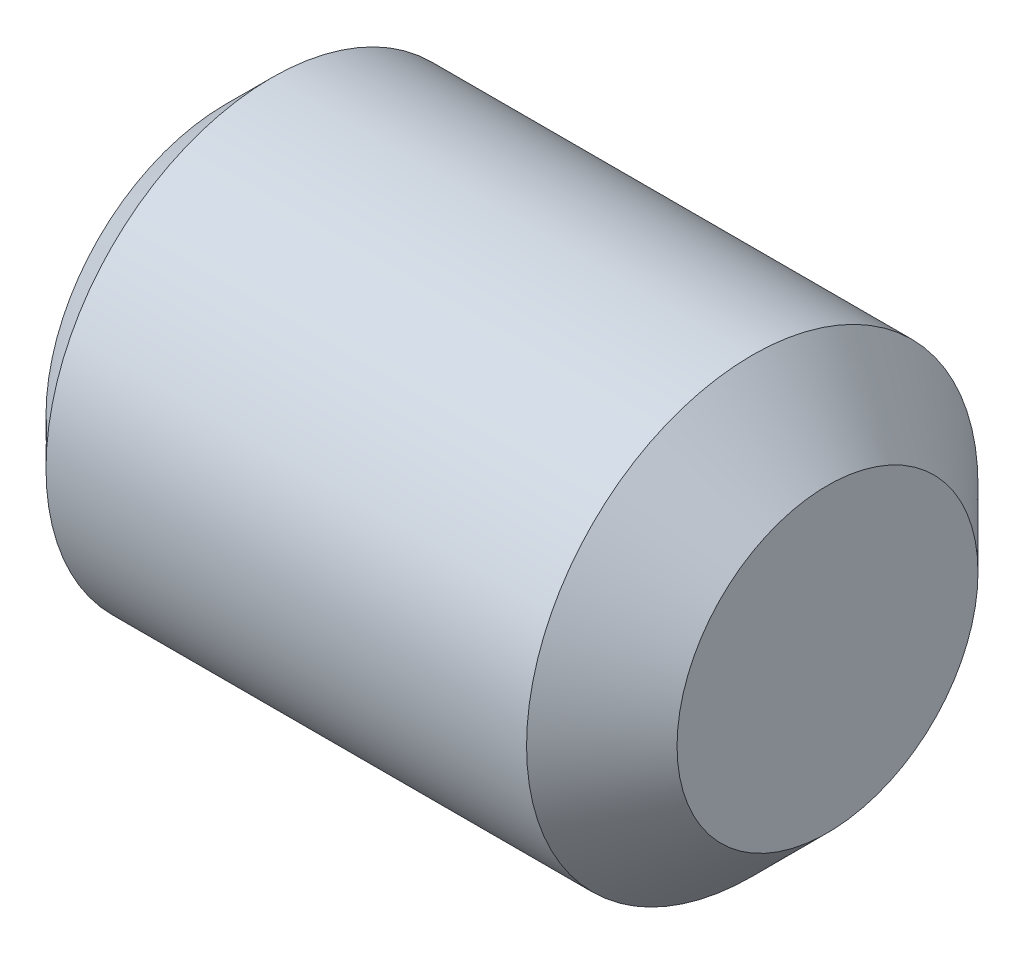
ISO-10303-21;
HEADER;
FILE_DESCRIPTION(('STEP AP214'),'2;1');
FILE_NAME('part.step','',(''),(''),'','','');
FILE_SCHEMA(('AUTOMOTIVE_DESIGN { 1 0 10303 214 1 1 1 1 }'));
ENDSEC;
DATA;
#1=APPLICATION_CONTEXT('core data for automotive mechanical design processes');
#2=APPLICATION_PROTOCOL_DEFINITION('international standard','automotive_design',2000,#1);
#3=PRODUCT_CONTEXT('',#1,'mechanical');
#4=PRODUCT('Part','Part','',(#3));
#5=PRODUCT_RELATED_PRODUCT_CATEGORY('part','',(#4));
#6=PRODUCT_DEFINITION_FORMATION('','',#4);
#7=PRODUCT_DEFINITION_CONTEXT('part definition',#1,'design');
#8=PRODUCT_DEFINITION('design','',#6,#7);
#9=PRODUCT_DEFINITION_SHAPE('','',#8);
#10=(LENGTH_UNIT() NAMED_UNIT(*) SI_UNIT(.MILLI.,.METRE.));
#11=(NAMED_UNIT(*) PLANE_ANGLE_UNIT() SI_UNIT($,.RADIAN.));
#12=(NAMED_UNIT(*) SI_UNIT($,.STERADIAN.) SOLID_ANGLE_UNIT());
#13=UNCERTAINTY_MEASURE_WITH_UNIT(LENGTH_MEASURE(1.E-05),#10,'distance_accuracy_value','');
#14=(GEOMETRIC_REPRESENTATION_CONTEXT(3) GLOBAL_UNCERTAINTY_ASSIGNED_CONTEXT((#13)) GLOBAL_UNIT_ASSIGNED_CONTEXT((#10,
#11,#12)) REPRESENTATION_CONTEXT('',''));
#15=CARTESIAN_POINT('',(0.,0.,0.));
#16=DIRECTION('',(0.,0.,1.));
#17=DIRECTION('',(1.,0.,0.));
#18=AXIS2_PLACEMENT_3D('',#15,#16,#17);
#19=CARTESIAN_POINT('',(0.,0.,0.));
#20=DIRECTION('',(1.,0.,0.));
#21=DIRECTION('',(0.,1.,0.));
#22=AXIS2_PLACEMENT_3D('',#19,#20,#21);
#23=PLANE('',#22);
#24=CARTESIAN_POINT('',(0.,0.,0.));
#25=DIRECTION('',(-1.,0.,0.));
#26=DIRECTION('',(0.,0.,-1.));
#27=AXIS2_PLACEMENT_3D('',#24,#25,#26);
#28=CIRCLE('',#27,0.75);
#29=CARTESIAN_POINT('',(0.,-0.649519052838329,-0.375));
#30=VERTEX_POINT('',#29);
#31=CARTESIAN_POINT('',(0.,-0.649519052838329,0.375));
#32=VERTEX_POINT('',#31);
#33=EDGE_CURVE('E41',#30,#32,#28,.T.);
#34=ORIENTED_EDGE('',*,*,#33,.F.);
#35=DIRECTION('',(0.,0.5,-0.866025403784439));
#36=VECTOR('',#35,1.);
#37=CARTESIAN_POINT('',(0.,-0.866025403784439,0.));
#38=LINE('',#37,#36);
#39=CARTESIAN_POINT('',(0.,-0.866025403784439,0.));
#40=VERTEX_POINT('',#39);
#41=EDGE_CURVE('E192',#40,#30,#38,.T.);
#42=ORIENTED_EDGE('',*,*,#41,.F.);
#43=DIRECTION('',(0.,-0.5,-0.866025403784439));
#44=VECTOR('',#43,1.);
#45=CARTESIAN_POINT('',(0.,-0.433012701892219,0.75));
#46=LINE('',#45,#44);
#47=EDGE_CURVE('E202',#32,#40,#46,.T.);
#48=ORIENTED_EDGE('',*,*,#47,.F.);
#49=EDGE_LOOP('',(#34,#42,#48));
#50=FACE_BOUND('',#49,.T.);
#51=ADVANCED_FACE('F16',(#50),#23,.F.);
#52=CARTESIAN_POINT('',(0.,0.,0.));
#53=DIRECTION('',(1.,0.,0.));
#54=DIRECTION('',(0.,1.,0.));
#55=AXIS2_PLACEMENT_3D('',#52,#53,#54);
#56=PLANE('',#55);
#57=CARTESIAN_POINT('',(0.,0.,0.));
#58=DIRECTION('',(-1.,0.,0.));
#59=DIRECTION('',(0.,0.,-1.));
#60=AXIS2_PLACEMENT_3D('',#57,#58,#59);
#61=CIRCLE('',#60,0.75);
#62=CARTESIAN_POINT('',(0.,0.,0.75));
#63=VERTEX_POINT('',#62);
#64=EDGE_CURVE('E144',#32,#63,#61,.T.);
#65=ORIENTED_EDGE('',*,*,#64,.F.);
#66=DIRECTION('',(0.,-0.5,-0.866025403784439));
#67=VECTOR('',#66,1.);
#68=CARTESIAN_POINT('',(0.,-0.433012701892219,0.75));
#69=LINE('',#68,#67);
#70=CARTESIAN_POINT('',(0.,-0.433012701892219,0.75));
#71=VERTEX_POINT('',#70);
#72=EDGE_CURVE('E206',#71,#32,#69,.T.);
#73=ORIENTED_EDGE('',*,*,#72,.F.);
#74=DIRECTION('',(0.,-1.,0.));
#75=VECTOR('',#74,1.);
#76=CARTESIAN_POINT('',(0.,0.433012701892219,0.75));
#77=LINE('',#76,#75);
#78=EDGE_CURVE('E173',#63,#71,#77,.T.);
#79=ORIENTED_EDGE('',*,*,#78,.F.);
#80=EDGE_LOOP('',(#65,#73,#79));
#81=FACE_BOUND('',#80,.T.);
#82=ADVANCED_FACE('F412',(#81),#56,.F.);
#83=CARTESIAN_POINT('',(0.,0.,0.));
#84=DIRECTION('',(1.,0.,0.));
#85=DIRECTION('',(0.,1.,0.));
#86=AXIS2_PLACEMENT_3D('',#83,#84,#85);
#87=PLANE('',#86);
#88=CARTESIAN_POINT('',(0.,0.,0.));
#89=DIRECTION('',(-1.,0.,0.));
#90=DIRECTION('',(0.,0.,-1.));
#91=AXIS2_PLACEMENT_3D('',#88,#89,#90);
#92=CIRCLE('',#91,0.75);
#93=CARTESIAN_POINT('',(0.,0.649519052838329,0.375));
#94=VERTEX_POINT('',#93);
#95=EDGE_CURVE('E141',#63,#94,#92,.T.);
#96=ORIENTED_EDGE('',*,*,#95,.F.);
#97=DIRECTION('',(0.,-1.,0.));
#98=VECTOR('',#97,1.);
#99=CARTESIAN_POINT('',(0.,0.433012701892219,0.75));
#100=LINE('',#99,#98);
#101=CARTESIAN_POINT('',(0.,0.433012701892219,0.75));
#102=VERTEX_POINT('',#101);
#103=EDGE_CURVE('E153',#102,#63,#100,.T.);
#104=ORIENTED_EDGE('',*,*,#103,.F.);
#105=DIRECTION('',(0.,-0.5,0.866025403784439));
#106=VECTOR('',#105,1.);
#107=CARTESIAN_POINT('',(0.,0.866025403784439,0.));
#108=LINE('',#107,#106);
#109=EDGE_CURVE('E150',#94,#102,#108,.T.);
#110=ORIENTED_EDGE('',*,*,#109,.F.);
#111=EDGE_LOOP('',(#96,#104,#110));
#112=FACE_BOUND('',#111,.T.);
#113=ADVANCED_FACE('F151',(#112),#87,.F.);
#114=CARTESIAN_POINT('',(0.,0.,0.));
#115=DIRECTION('',(1.,0.,0.));
#116=DIRECTION('',(0.,1.,0.));
#117=AXIS2_PLACEMENT_3D('',#114,#115,#116);
#118=PLANE('',#117);
#119=CARTESIAN_POINT('',(0.,0.,0.));
#120=DIRECTION('',(-1.,0.,0.));
#121=DIRECTION('',(0.,0.,-1.));
#122=AXIS2_PLACEMENT_3D('',#119,#120,#121);
#123=CIRCLE('',#122,0.75);
#124=CARTESIAN_POINT('',(0.,0.649519052838329,-0.375));
#125=VERTEX_POINT('',#124);
#126=EDGE_CURVE('E20',#94,#125,#123,.T.);
#127=ORIENTED_EDGE('',*,*,#126,.F.);
#128=DIRECTION('',(0.,-0.5,0.866025403784439));
#129=VECTOR('',#128,1.);
#130=CARTESIAN_POINT('',(0.,0.866025403784439,0.));
#131=LINE('',#130,#129);
#132=CARTESIAN_POINT('',(0.,0.866025403784439,0.));
#133=VERTEX_POINT('',#132);
#134=EDGE_CURVE('E71',#133,#94,#131,.T.);
#135=ORIENTED_EDGE('',*,*,#134,.F.);
#136=DIRECTION('',(0.,0.5,0.866025403784439));
#137=VECTOR('',#136,1.);
#138=CARTESIAN_POINT('',(0.,0.433012701892219,-0.75));
#139=LINE('',#138,#137);
#140=EDGE_CURVE('E169',#125,#133,#139,.T.);
#141=ORIENTED_EDGE('',*,*,#140,.F.);
#142=EDGE_LOOP('',(#127,#135,#141));
#143=FACE_BOUND('',#142,.T.);
#144=ADVANCED_FACE('F275',(#143),#118,.F.);
#145=CARTESIAN_POINT('',(0.,0.,0.));
#146=DIRECTION('',(1.,0.,0.));
#147=DIRECTION('',(0.,1.,0.));
#148=AXIS2_PLACEMENT_3D('',#145,#146,#147);
#149=PLANE('',#148);
#150=CARTESIAN_POINT('',(0.,0.,0.));
#151=DIRECTION('',(-1.,0.,0.));
#152=DIRECTION('',(0.,0.,-1.));
#153=AXIS2_PLACEMENT_3D('',#150,#151,#152);
#154=CIRCLE('',#153,0.75);
#155=CARTESIAN_POINT('',(0.,0.,-0.75));
#156=VERTEX_POINT('',#155);
#157=EDGE_CURVE('E218',#156,#30,#154,.T.);
#158=ORIENTED_EDGE('',*,*,#157,.F.);
#159=DIRECTION('',(0.,1.,0.));
#160=VECTOR('',#159,1.);
#161=CARTESIAN_POINT('',(0.,-0.433012701892219,-0.75));
#162=LINE('',#161,#160);
#163=CARTESIAN_POINT('',(0.,-0.433012701892219,-0.75));
#164=VERTEX_POINT('',#163);
#165=EDGE_CURVE('E201',#164,#156,#162,.T.);
#166=ORIENTED_EDGE('',*,*,#165,.F.);
#167=DIRECTION('',(0.,0.5,-0.866025403784439));
#168=VECTOR('',#167,1.);
#169=CARTESIAN_POINT('',(0.,-0.866025403784439,0.));
#170=LINE('',#169,#168);
#171=EDGE_CURVE('E188',#30,#164,#170,.T.);
#172=ORIENTED_EDGE('',*,*,#171,.F.);
#173=EDGE_LOOP('',(#158,#166,#172));
#174=FACE_BOUND('',#173,.T.);
#175=ADVANCED_FACE('F394',(#174),#149,.F.);
#176=CARTESIAN_POINT('',(-2.,0.,0.));
#177=DIRECTION('',(1.,0.,0.));
#178=DIRECTION('',(0.,1.,0.));
#179=AXIS2_PLACEMENT_3D('',#176,#177,#178);
#180=PLANE('',#179);
#181=CARTESIAN_POINT('',(-2.,0.,0.));
#182=DIRECTION('',(1.,0.,0.));
#183=DIRECTION('',(0.,0.,-1.));
#184=AXIS2_PLACEMENT_3D('',#181,#182,#183);
#185=CIRCLE('',#184,1.1935);
#186=CARTESIAN_POINT('',(-2.,0.,-1.1935));
#187=VERTEX_POINT('',#186);
#188=EDGE_CURVE('E217',#187,#187,#185,.T.);
#189=ORIENTED_EDGE('',*,*,#188,.F.);
#190=EDGE_LOOP('',(#189));
#191=FACE_BOUND('',#190,.T.);
#192=DIRECTION('',(0.,-1.,0.));
#193=VECTOR('',#192,1.);
#194=CARTESIAN_POINT('',(-2.,0.433012701892219,0.75));
#195=LINE('',#194,#193);
#196=CARTESIAN_POINT('',(-2.,0.433012701892219,0.75));
#197=VERTEX_POINT('',#196);
#198=CARTESIAN_POINT('',(-2.,-0.433012701892219,0.75));
#199=VERTEX_POINT('',#198);
#200=EDGE_CURVE('E11',#197,#199,#195,.T.);
#201=ORIENTED_EDGE('',*,*,#200,.T.);
#202=DIRECTION('',(0.,-0.5,-0.866025403784439));
#203=VECTOR('',#202,1.);
#204=CARTESIAN_POINT('',(-2.,-0.433012701892219,0.75));
#205=LINE('',#204,#203);
#206=CARTESIAN_POINT('',(-2.,-0.866025403784439,0.));
#207=VERTEX_POINT('',#206);
#208=EDGE_CURVE('E27',#199,#207,#205,.T.);
#209=ORIENTED_EDGE('',*,*,#208,.T.);
#210=DIRECTION('',(0.,0.5,-0.866025403784439));
#211=VECTOR('',#210,1.);
#212=CARTESIAN_POINT('',(-2.,-0.866025403784439,0.));
#213=LINE('',#212,#211);
#214=CARTESIAN_POINT('',(-2.,-0.433012701892219,-0.75));
#215=VERTEX_POINT('',#214);
#216=EDGE_CURVE('E194',#207,#215,#213,.T.);
#217=ORIENTED_EDGE('',*,*,#216,.T.);
#218=DIRECTION('',(0.,1.,0.));
#219=VECTOR('',#218,1.);
#220=CARTESIAN_POINT('',(-2.,-0.433012701892219,-0.75));
#221=LINE('',#220,#219);
#222=CARTESIAN_POINT('',(-2.,0.433012701892219,-0.75));
#223=VERTEX_POINT('',#222);
#224=EDGE_CURVE('E179',#215,#223,#221,.T.);
#225=ORIENTED_EDGE('',*,*,#224,.T.);
#226=DIRECTION('',(0.,0.5,0.866025403784439));
#227=VECTOR('',#226,1.);
#228=CARTESIAN_POINT('',(-2.,0.433012701892219,-0.75));
#229=LINE('',#228,#227);
#230=CARTESIAN_POINT('',(-2.,0.866025403784439,0.));
#231=VERTEX_POINT('',#230);
#232=EDGE_CURVE('E175',#223,#231,#229,.T.);
#233=ORIENTED_EDGE('',*,*,#232,.T.);
#234=DIRECTION('',(0.,-0.5,0.866025403784439));
#235=VECTOR('',#234,1.);
#236=CARTESIAN_POINT('',(-2.,0.866025403784439,0.));
#237=LINE('',#236,#235);
#238=EDGE_CURVE('E180',#231,#197,#237,.T.);
#239=ORIENTED_EDGE('',*,*,#238,.T.);
#240=EDGE_LOOP('',(#201,#209,#217,#225,#233,#239));
#241=FACE_BOUND('',#240,.T.);
#242=ADVANCED_FACE('F266',(#191,#241),#180,.F.);
#243=CARTESIAN_POINT('',(-2.,0.,0.));
#244=DIRECTION('',(1.,0.,0.));
#245=DIRECTION('',(0.,0.,-1.));
#246=AXIS2_PLACEMENT_3D('',#243,#244,#245);
#247=CONICAL_SURFACE('',#246,1.1935,0.785398163397448);
#248=CARTESIAN_POINT('',(-1.6935,0.,0.));
#249=DIRECTION('',(1.,0.,0.));
#250=DIRECTION('',(0.,0.,-1.));
#251=AXIS2_PLACEMENT_3D('',#248,#249,#250);
#252=CIRCLE('',#251,1.5);
#253=CARTESIAN_POINT('',(-1.6935,0.,-1.5));
#254=VERTEX_POINT('',#253);
#255=EDGE_CURVE('E110',#254,#254,#252,.T.);
#256=ORIENTED_EDGE('',*,*,#255,.F.);
#257=EDGE_LOOP('',(#256));
#258=FACE_BOUND('',#257,.T.);
#259=ORIENTED_EDGE('',*,*,#188,.T.);
#260=EDGE_LOOP('',(#259));
#261=FACE_BOUND('',#260,.T.);
#262=ADVANCED_FACE('F428',(#258,#261),#247,.T.);
#263=CARTESIAN_POINT('',(2.,0.,0.));
#264=DIRECTION('',(1.,0.,0.));
#265=DIRECTION('',(0.,0.,-1.));
#266=AXIS2_PLACEMENT_3D('',#263,#264,#265);
#267=CYLINDRICAL_SURFACE('',#266,1.5);
#268=CARTESIAN_POINT('',(1.5,0.,0.));
#269=DIRECTION('',(1.,0.,0.));
#270=DIRECTION('',(0.,0.,-1.));
#271=AXIS2_PLACEMENT_3D('',#268,#269,#270);
#272=CIRCLE('',#271,1.5);
#273=CARTESIAN_POINT('',(1.5,0.,-1.5));
#274=VERTEX_POINT('',#273);
#275=EDGE_CURVE('E121',#274,#274,#272,.T.);
#276=ORIENTED_EDGE('',*,*,#275,.F.);
#277=EDGE_LOOP('',(#276));
#278=FACE_BOUND('',#277,.T.);
#279=ORIENTED_EDGE('',*,*,#255,.T.);
#280=EDGE_LOOP('',(#279));
#281=FACE_BOUND('',#280,.T.);
#282=ADVANCED_FACE('F466',(#278,#281),#267,.T.);
#283=CARTESIAN_POINT('',(1.5,0.,0.));
#284=DIRECTION('',(-1.,0.,0.));
#285=DIRECTION('',(0.,0.,1.));
#286=AXIS2_PLACEMENT_3D('',#283,#284,#285);
#287=CONICAL_SURFACE('',#286,1.5,0.785398163397448);
#288=CARTESIAN_POINT('',(2.,0.,0.));
#289=DIRECTION('',(1.,0.,0.));
#290=DIRECTION('',(0.,0.,-1.));
#291=AXIS2_PLACEMENT_3D('',#288,#289,#290);
#292=CIRCLE('',#291,1.);
#293=CARTESIAN_POINT('',(2.,0.,-1.));
#294=VERTEX_POINT('',#293);
#295=EDGE_CURVE('E181',#294,#294,#292,.T.);
#296=ORIENTED_EDGE('',*,*,#295,.F.);
#297=EDGE_LOOP('',(#296));
#298=FACE_BOUND('',#297,.T.);
#299=ORIENTED_EDGE('',*,*,#275,.T.);
#300=EDGE_LOOP('',(#299));
#301=FACE_BOUND('',#300,.T.);
#302=ADVANCED_FACE('F461',(#298,#301),#287,.T.);
#303=CARTESIAN_POINT('',(2.,1.,0.));
#304=DIRECTION('',(-1.,0.,0.));
#305=DIRECTION('',(0.,0.,1.));
#306=AXIS2_PLACEMENT_3D('',#303,#304,#305);
#307=PLANE('',#306);
#308=ORIENTED_EDGE('',*,*,#295,.T.);
#309=EDGE_LOOP('',(#308));
#310=FACE_BOUND('',#309,.T.);
#311=ADVANCED_FACE('F465',(#310),#307,.F.);
#312=CARTESIAN_POINT('',(0.,0.433012701892219,0.75));
#313=DIRECTION('',(0.,0.,-1.));
#314=DIRECTION('',(0.,-1.,0.));
#315=AXIS2_PLACEMENT_3D('',#312,#313,#314);
#316=PLANE('',#315);
#317=ORIENTED_EDGE('',*,*,#200,.F.);
#318=DIRECTION('',(-1.,0.,0.));
#319=VECTOR('',#318,1.);
#320=CARTESIAN_POINT('',(0.,0.433012701892219,0.75));
#321=LINE('',#320,#319);
#322=EDGE_CURVE('E149',#102,#197,#321,.T.);
#323=ORIENTED_EDGE('',*,*,#322,.F.);
#324=ORIENTED_EDGE('',*,*,#103,.T.);
#325=ORIENTED_EDGE('',*,*,#78,.T.);
#326=DIRECTION('',(-1.,0.,0.));
#327=VECTOR('',#326,1.);
#328=CARTESIAN_POINT('',(0.,-0.433012701892219,0.75));
#329=LINE('',#328,#327);
#330=EDGE_CURVE('E211',#71,#199,#329,.T.);
#331=ORIENTED_EDGE('',*,*,#330,.T.);
#332=EDGE_LOOP('',(#317,#323,#324,#325,#331));
#333=FACE_BOUND('',#332,.T.);
#334=ADVANCED_FACE('F403',(#333),#316,.T.);
#335=CARTESIAN_POINT('',(0.,-0.433012701892219,0.75));
#336=DIRECTION('',(0.,0.866025403784439,-0.5));
#337=DIRECTION('',(-1.,0.,0.));
#338=AXIS2_PLACEMENT_3D('',#335,#336,#337);
#339=PLANE('',#338);
#340=ORIENTED_EDGE('',*,*,#208,.F.);
#341=ORIENTED_EDGE('',*,*,#330,.F.);
#342=ORIENTED_EDGE('',*,*,#72,.T.);
#343=ORIENTED_EDGE('',*,*,#47,.T.);
#344=DIRECTION('',(-1.,0.,0.));
#345=VECTOR('',#344,1.);
#346=CARTESIAN_POINT('',(0.,-0.866025403784439,0.));
#347=LINE('',#346,#345);
#348=EDGE_CURVE('E207',#40,#207,#347,.T.);
#349=ORIENTED_EDGE('',*,*,#348,.T.);
#350=EDGE_LOOP('',(#340,#341,#342,#343,#349));
#351=FACE_BOUND('',#350,.T.);
#352=ADVANCED_FACE('F398',(#351),#339,.T.);
#353=CARTESIAN_POINT('',(0.,-0.866025403784439,0.));
#354=DIRECTION('',(0.,0.866025403784439,0.5));
#355=DIRECTION('',(1.,0.,0.));
#356=AXIS2_PLACEMENT_3D('',#353,#354,#355);
#357=PLANE('',#356);
#358=ORIENTED_EDGE('',*,*,#216,.F.);
#359=ORIENTED_EDGE('',*,*,#348,.F.);
#360=ORIENTED_EDGE('',*,*,#41,.T.);
#361=ORIENTED_EDGE('',*,*,#171,.T.);
#362=DIRECTION('',(-1.,0.,0.));
#363=VECTOR('',#362,1.);
#364=CARTESIAN_POINT('',(0.,-0.433012701892219,-0.75));
#365=LINE('',#364,#363);
#366=EDGE_CURVE('E193',#164,#215,#365,.T.);
#367=ORIENTED_EDGE('',*,*,#366,.T.);
#368=EDGE_LOOP('',(#358,#359,#360,#361,#367));
#369=FACE_BOUND('',#368,.T.);
#370=ADVANCED_FACE('F402',(#369),#357,.T.);
#371=CARTESIAN_POINT('',(0.,-0.433012701892219,-0.75));
#372=DIRECTION('',(0.,0.,1.));
#373=DIRECTION('',(1.,0.,0.));
#374=AXIS2_PLACEMENT_3D('',#371,#372,#373);
#375=PLANE('',#374);
#376=ORIENTED_EDGE('',*,*,#224,.F.);
#377=ORIENTED_EDGE('',*,*,#366,.F.);
#378=ORIENTED_EDGE('',*,*,#165,.T.);
#379=DIRECTION('',(0.,1.,0.));
#380=VECTOR('',#379,1.);
#381=CARTESIAN_POINT('',(0.,-0.433012701892219,-0.75));
#382=LINE('',#381,#380);
#383=CARTESIAN_POINT('',(0.,0.433012701892219,-0.75));
#384=VERTEX_POINT('',#383);
#385=EDGE_CURVE('E246',#156,#384,#382,.T.);
#386=ORIENTED_EDGE('',*,*,#385,.T.);
#387=DIRECTION('',(-1.,0.,0.));
#388=VECTOR('',#387,1.);
#389=CARTESIAN_POINT('',(0.,0.433012701892219,-0.75));
#390=LINE('',#389,#388);
#391=EDGE_CURVE('E233',#384,#223,#390,.T.);
#392=ORIENTED_EDGE('',*,*,#391,.T.);
#393=EDGE_LOOP('',(#376,#377,#378,#386,#392));
#394=FACE_BOUND('',#393,.T.);
#395=ADVANCED_FACE('F270',(#394),#375,.T.);
#396=CARTESIAN_POINT('',(0.,0.433012701892219,-0.75));
#397=DIRECTION('',(0.,-0.866025403784439,0.5));
#398=DIRECTION('',(-1.,0.,0.));
#399=AXIS2_PLACEMENT_3D('',#396,#397,#398);
#400=PLANE('',#399);
#401=ORIENTED_EDGE('',*,*,#232,.F.);
#402=ORIENTED_EDGE('',*,*,#391,.F.);
#403=DIRECTION('',(0.,0.5,0.866025403784439));
#404=VECTOR('',#403,1.);
#405=CARTESIAN_POINT('',(0.,0.433012701892219,-0.75));
#406=LINE('',#405,#404);
#407=EDGE_CURVE('E187',#384,#125,#406,.T.);
#408=ORIENTED_EDGE('',*,*,#407,.T.);
#409=ORIENTED_EDGE('',*,*,#140,.T.);
#410=DIRECTION('',(-1.,0.,0.));
#411=VECTOR('',#410,1.);
#412=CARTESIAN_POINT('',(0.,0.866025403784439,0.));
#413=LINE('',#412,#411);
#414=EDGE_CURVE('E162',#133,#231,#413,.T.);
#415=ORIENTED_EDGE('',*,*,#414,.T.);
#416=EDGE_LOOP('',(#401,#402,#408,#409,#415));
#417=FACE_BOUND('',#416,.T.);
#418=ADVANCED_FACE('F18',(#417),#400,.T.);
#419=CARTESIAN_POINT('',(0.,0.866025403784439,0.));
#420=DIRECTION('',(0.,-0.866025403784439,-0.5));
#421=DIRECTION('',(0.,0.5,-0.866025403784439));
#422=AXIS2_PLACEMENT_3D('',#419,#420,#421);
#423=PLANE('',#422);
#424=ORIENTED_EDGE('',*,*,#238,.F.);
#425=ORIENTED_EDGE('',*,*,#414,.F.);
#426=ORIENTED_EDGE('',*,*,#134,.T.);
#427=ORIENTED_EDGE('',*,*,#109,.T.);
#428=ORIENTED_EDGE('',*,*,#322,.T.);
#429=EDGE_LOOP('',(#424,#425,#426,#427,#428));
#430=FACE_BOUND('',#429,.T.);
#431=ADVANCED_FACE('F160',(#430),#423,.T.);
#432=CARTESIAN_POINT('',(0.,0.,0.));
#433=DIRECTION('',(1.,0.,0.));
#434=DIRECTION('',(0.,1.,0.));
#435=AXIS2_PLACEMENT_3D('',#432,#433,#434);
#436=PLANE('',#435);
#437=CARTESIAN_POINT('',(0.,0.,0.));
#438=DIRECTION('',(-1.,0.,0.));
#439=DIRECTION('',(0.,0.,-1.));
#440=AXIS2_PLACEMENT_3D('',#437,#438,#439);
#441=CIRCLE('',#440,0.75);
#442=EDGE_CURVE('E221',#125,#156,#441,.T.);
#443=ORIENTED_EDGE('',*,*,#442,.F.);
#444=ORIENTED_EDGE('',*,*,#407,.F.);
#445=ORIENTED_EDGE('',*,*,#385,.F.);
#446=EDGE_LOOP('',(#443,#444,#445));
#447=FACE_BOUND('',#446,.T.);
#448=ADVANCED_FACE('F137',(#447),#436,.F.);
#449=CARTESIAN_POINT('',(0.,0.,0.));
#450=DIRECTION('',(-1.,0.,0.));
#451=DIRECTION('',(0.,0.,1.));
#452=AXIS2_PLACEMENT_3D('',#449,#450,#451);
#453=CONICAL_SURFACE('',#452,0.75,1.0471975511966);
#454=CARTESIAN_POINT('',(0.433012701892219,0.,0.));
#455=VERTEX_POINT('',#454);
#456=VERTEX_LOOP('',#455);
#457=FACE_BOUND('',#456,.T.);
#458=ORIENTED_EDGE('',*,*,#95,.T.);
#459=ORIENTED_EDGE('',*,*,#126,.T.);
#460=ORIENTED_EDGE('',*,*,#442,.T.);
#461=ORIENTED_EDGE('',*,*,#157,.T.);
#462=ORIENTED_EDGE('',*,*,#33,.T.);
#463=ORIENTED_EDGE('',*,*,#64,.T.);
#464=EDGE_LOOP('',(#458,#459,#460,#461,#462,#463));
#465=FACE_BOUND('',#464,.T.);
#466=ADVANCED_FACE('F135',(#457,#465),#453,.F.);
#467=CLOSED_SHELL('',(#51,#82,#113,#144,#175,#242,#262,#282,#302,#311,#334,#352,#370,#395,#418,
#431,#448,#466));
#468=MANIFOLD_SOLID_BREP('B1',#467);
#469=ADVANCED_BREP_SHAPE_REPRESENTATION('',(#18,#468),#14);
#470=SHAPE_DEFINITION_REPRESENTATION(#9,#469);
ENDSEC;
END-ISO-10303-21;
